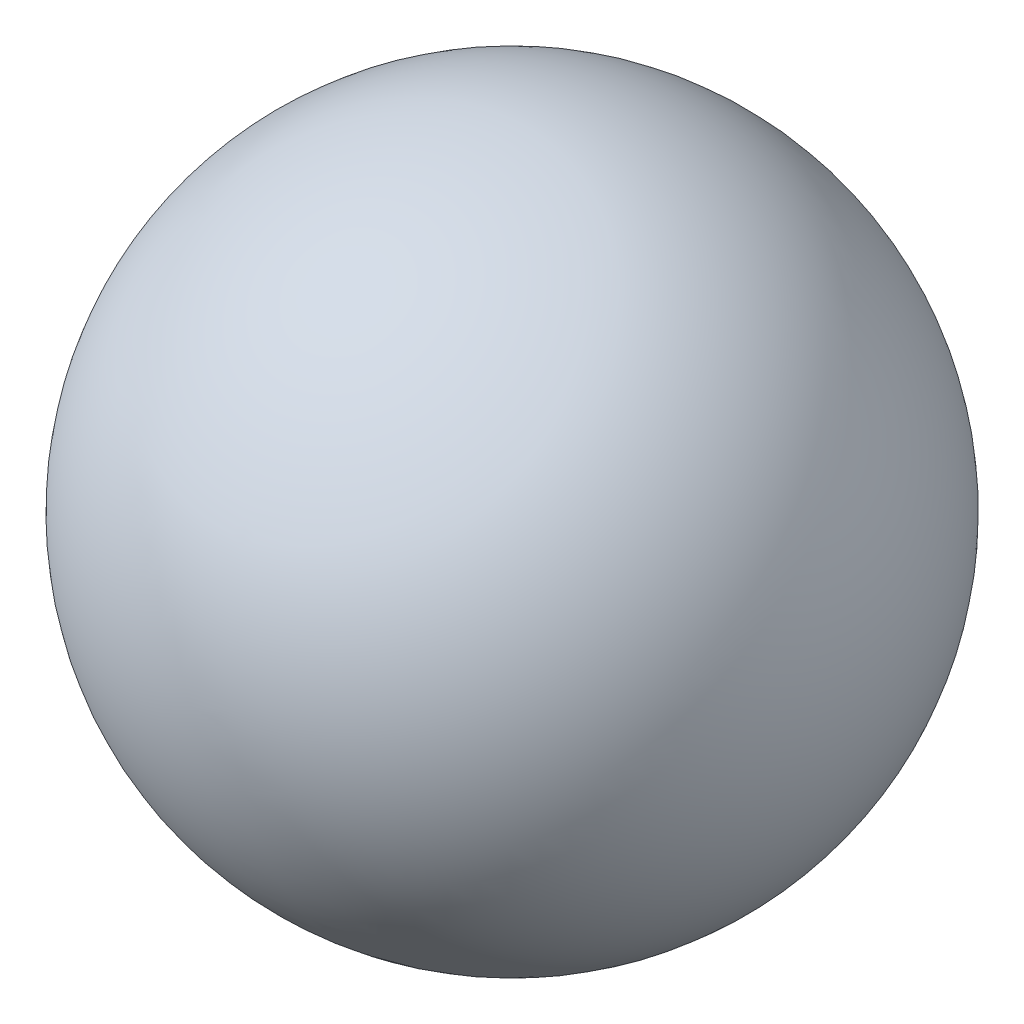
ISO-10303-21;
HEADER;
FILE_DESCRIPTION(('STEP AP214'),'2;1');
FILE_NAME('part.step','',(''),(''),'','','');
FILE_SCHEMA(('AUTOMOTIVE_DESIGN { 1 0 10303 214 1 1 1 1 }'));
ENDSEC;
DATA;
#1=APPLICATION_CONTEXT('core data for automotive mechanical design processes');
#2=APPLICATION_PROTOCOL_DEFINITION('international standard','automotive_design',2000,#1);
#3=PRODUCT_CONTEXT('',#1,'mechanical');
#4=PRODUCT('Part','Part','',(#3));
#5=PRODUCT_RELATED_PRODUCT_CATEGORY('part','',(#4));
#6=PRODUCT_DEFINITION_FORMATION('','',#4);
#7=PRODUCT_DEFINITION_CONTEXT('part definition',#1,'design');
#8=PRODUCT_DEFINITION('design','',#6,#7);
#9=PRODUCT_DEFINITION_SHAPE('','',#8);
#10=(LENGTH_UNIT() NAMED_UNIT(*) SI_UNIT(.MILLI.,.METRE.));
#11=(NAMED_UNIT(*) PLANE_ANGLE_UNIT() SI_UNIT($,.RADIAN.));
#12=(NAMED_UNIT(*) SI_UNIT($,.STERADIAN.) SOLID_ANGLE_UNIT());
#13=UNCERTAINTY_MEASURE_WITH_UNIT(LENGTH_MEASURE(1.E-05),#10,'distance_accuracy_value','');
#14=(GEOMETRIC_REPRESENTATION_CONTEXT(3) GLOBAL_UNCERTAINTY_ASSIGNED_CONTEXT((#13)) GLOBAL_UNIT_ASSIGNED_CONTEXT((#10,
#11,#12)) REPRESENTATION_CONTEXT('',''));
#15=CARTESIAN_POINT('',(0.,0.,0.));
#16=DIRECTION('',(0.,0.,1.));
#17=DIRECTION('',(1.,0.,0.));
#18=AXIS2_PLACEMENT_3D('',#15,#16,#17);
#19=CARTESIAN_POINT('',(49.75,43.0306313387175,30.9404551815481));
#20=DIRECTION('',(0.,0.811906363998105,0.583787680667704));
#21=DIRECTION('',(0.173648177666933,-0.57491863403457,0.799571681985285));
#22=AXIS2_PLACEMENT_3D('',#19,#20,#21);
#23=SPHERICAL_SURFACE('',#22,5.95);
#24=CARTESIAN_POINT('',(49.75,47.8614742045062,34.4139918815209));
#25=VERTEX_POINT('',#24);
#26=VERTEX_LOOP('',#25);
#27=FACE_BOUND('',#26,.T.);
#28=CARTESIAN_POINT('',(49.75,38.1997884729288,27.4669184815753));
#29=VERTEX_POINT('',#28);
#30=VERTEX_LOOP('',#29);
#31=FACE_BOUND('',#30,.T.);
#32=ADVANCED_FACE('F16',(#27,#31),#23,.T.);
#33=CLOSED_SHELL('',(#32));
#34=MANIFOLD_SOLID_BREP('B1',#33);
#35=ADVANCED_BREP_SHAPE_REPRESENTATION('',(#18,#34),#14);
#36=SHAPE_DEFINITION_REPRESENTATION(#9,#35);
ENDSEC;
END-ISO-10303-21;
